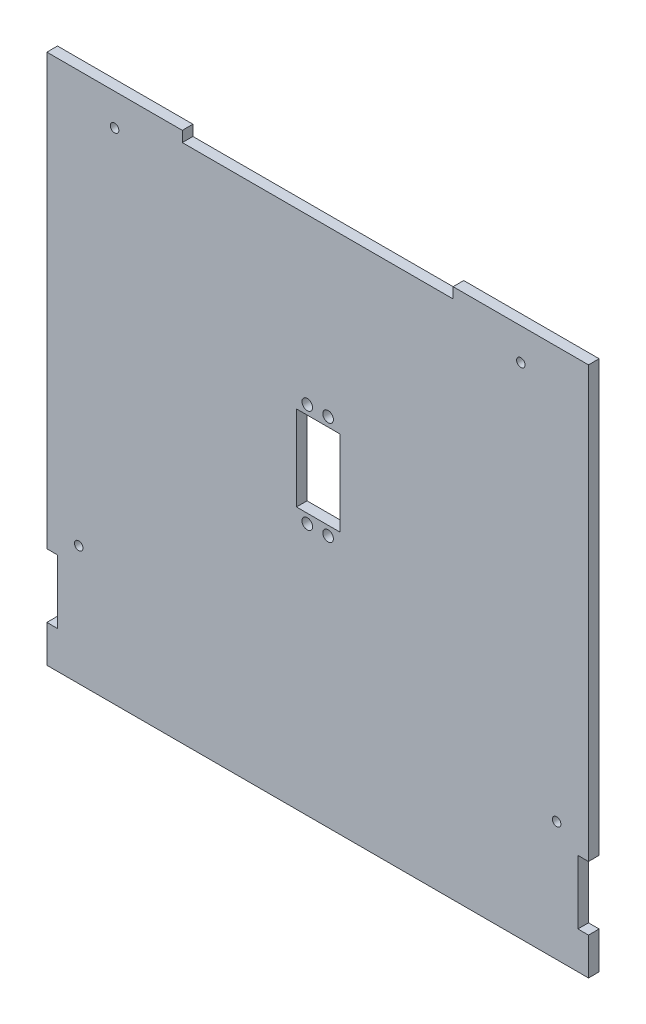
ISO-10303-21;
HEADER;
FILE_DESCRIPTION(('STEP AP214'),'2;1');
FILE_NAME('part.step','',(''),(''),'','','');
FILE_SCHEMA(('AUTOMOTIVE_DESIGN { 1 0 10303 214 1 1 1 1 }'));
ENDSEC;
DATA;
#1=APPLICATION_CONTEXT('core data for automotive mechanical design processes');
#2=APPLICATION_PROTOCOL_DEFINITION('international standard','automotive_design',2000,#1);
#3=PRODUCT_CONTEXT('',#1,'mechanical');
#4=PRODUCT('Part','Part','',(#3));
#5=PRODUCT_RELATED_PRODUCT_CATEGORY('part','',(#4));
#6=PRODUCT_DEFINITION_FORMATION('','',#4);
#7=PRODUCT_DEFINITION_CONTEXT('part definition',#1,'design');
#8=PRODUCT_DEFINITION('design','',#6,#7);
#9=PRODUCT_DEFINITION_SHAPE('','',#8);
#10=(LENGTH_UNIT() NAMED_UNIT(*) SI_UNIT(.MILLI.,.METRE.));
#11=(NAMED_UNIT(*) PLANE_ANGLE_UNIT() SI_UNIT($,.RADIAN.));
#12=(NAMED_UNIT(*) SI_UNIT($,.STERADIAN.) SOLID_ANGLE_UNIT());
#13=UNCERTAINTY_MEASURE_WITH_UNIT(LENGTH_MEASURE(1.E-05),#10,'distance_accuracy_value','');
#14=(GEOMETRIC_REPRESENTATION_CONTEXT(3) GLOBAL_UNCERTAINTY_ASSIGNED_CONTEXT((#13)) GLOBAL_UNIT_ASSIGNED_CONTEXT((#10,
#11,#12)) REPRESENTATION_CONTEXT('',''));
#15=CARTESIAN_POINT('',(0.,0.,0.));
#16=DIRECTION('',(0.,0.,1.));
#17=DIRECTION('',(1.,0.,0.));
#18=AXIS2_PLACEMENT_3D('',#15,#16,#17);
#19=CARTESIAN_POINT('',(0.,0.,5.));
#20=DIRECTION('',(0.,0.,1.));
#21=DIRECTION('',(1.,0.,0.));
#22=AXIS2_PLACEMENT_3D('',#19,#20,#21);
#23=PLANE('',#22);
#24=CARTESIAN_POINT('',(110.,-68.75,5.));
#25=DIRECTION('',(0.,0.,1.));
#26=DIRECTION('',(1.,0.,0.));
#27=AXIS2_PLACEMENT_3D('',#24,#25,#26);
#28=CIRCLE('',#27,2.);
#29=CARTESIAN_POINT('',(112.,-68.75,5.));
#30=VERTEX_POINT('',#29);
#31=EDGE_CURVE('E189',#30,#30,#28,.T.);
#32=ORIENTED_EDGE('',*,*,#31,.F.);
#33=EDGE_LOOP('',(#32));
#34=FACE_BOUND('',#33,.T.);
#35=CARTESIAN_POINT('',(-115.,-68.75,5.));
#36=DIRECTION('',(0.,0.,1.));
#37=DIRECTION('',(1.,0.,0.));
#38=AXIS2_PLACEMENT_3D('',#35,#36,#37);
#39=CIRCLE('',#38,2.);
#40=CARTESIAN_POINT('',(-113.,-68.75,5.));
#41=VERTEX_POINT('',#40);
#42=EDGE_CURVE('E351',#41,#41,#39,.T.);
#43=ORIENTED_EDGE('',*,*,#42,.F.);
#44=EDGE_LOOP('',(#43));
#45=FACE_BOUND('',#44,.T.);
#46=CARTESIAN_POINT('',(-98.125,110.,5.));
#47=DIRECTION('',(0.,0.,1.));
#48=DIRECTION('',(1.,0.,0.));
#49=AXIS2_PLACEMENT_3D('',#46,#47,#48);
#50=CIRCLE('',#49,2.);
#51=CARTESIAN_POINT('',(-96.125,110.,5.));
#52=VERTEX_POINT('',#51);
#53=EDGE_CURVE('E354',#52,#52,#50,.T.);
#54=ORIENTED_EDGE('',*,*,#53,.F.);
#55=EDGE_LOOP('',(#54));
#56=FACE_BOUND('',#55,.T.);
#57=CARTESIAN_POINT('',(93.125,110.,5.));
#58=DIRECTION('',(0.,0.,1.));
#59=DIRECTION('',(1.,0.,0.));
#60=AXIS2_PLACEMENT_3D('',#57,#58,#59);
#61=CIRCLE('',#60,2.);
#62=CARTESIAN_POINT('',(95.125,110.,5.));
#63=VERTEX_POINT('',#62);
#64=EDGE_CURVE('E357',#63,#63,#61,.T.);
#65=ORIENTED_EDGE('',*,*,#64,.F.);
#66=EDGE_LOOP('',(#65));
#67=FACE_BOUND('',#66,.T.);
#68=DIRECTION('',(0.,-1.,0.));
#69=VECTOR('',#68,1.);
#70=CARTESIAN_POINT('',(-66.25,0.,5.));
#71=LINE('',#70,#69);
#72=CARTESIAN_POINT('',(-66.25,125.,5.));
#73=VERTEX_POINT('',#72);
#74=CARTESIAN_POINT('',(-66.25,120.,5.));
#75=VERTEX_POINT('',#74);
#76=EDGE_CURVE('E339',#73,#75,#71,.T.);
#77=ORIENTED_EDGE('',*,*,#76,.F.);
#78=DIRECTION('',(-1.,0.,0.));
#79=VECTOR('',#78,1.);
#80=CARTESIAN_POINT('',(-130.,125.,5.));
#81=LINE('',#80,#79);
#82=CARTESIAN_POINT('',(-130.,125.,5.));
#83=VERTEX_POINT('',#82);
#84=EDGE_CURVE('E198',#73,#83,#81,.T.);
#85=ORIENTED_EDGE('',*,*,#84,.T.);
#86=DIRECTION('',(0.,1.,0.));
#87=VECTOR('',#86,1.);
#88=CARTESIAN_POINT('',(-130.,0.,5.));
#89=LINE('',#88,#87);
#90=CARTESIAN_POINT('',(-130.,-77.5,5.));
#91=VERTEX_POINT('',#90);
#92=EDGE_CURVE('E321',#91,#83,#89,.T.);
#93=ORIENTED_EDGE('',*,*,#92,.F.);
#94=DIRECTION('',(-1.,0.,0.));
#95=VECTOR('',#94,1.);
#96=CARTESIAN_POINT('',(4.30211422042244E-13,-77.4999999999993,5.));
#97=LINE('',#96,#95);
#98=CARTESIAN_POINT('',(-125.,-77.5,5.));
#99=VERTEX_POINT('',#98);
#100=EDGE_CURVE('E266',#99,#91,#97,.T.);
#101=ORIENTED_EDGE('',*,*,#100,.F.);
#102=DIRECTION('',(0.,1.,0.));
#103=VECTOR('',#102,1.);
#104=CARTESIAN_POINT('',(-125.,0.,5.));
#105=LINE('',#104,#103);
#106=CARTESIAN_POINT('',(-125.,-107.5,5.));
#107=VERTEX_POINT('',#106);
#108=EDGE_CURVE('E264',#107,#99,#105,.T.);
#109=ORIENTED_EDGE('',*,*,#108,.F.);
#110=DIRECTION('',(1.,0.,0.));
#111=VECTOR('',#110,1.);
#112=CARTESIAN_POINT('',(5.96744875736017E-13,-107.499999999999,5.));
#113=LINE('',#112,#111);
#114=CARTESIAN_POINT('',(-130.,-107.5,5.));
#115=VERTEX_POINT('',#114);
#116=EDGE_CURVE('E269',#115,#107,#113,.T.);
#117=ORIENTED_EDGE('',*,*,#116,.F.);
#118=CARTESIAN_POINT('',(-130.,-125.,5.));
#119=VERTEX_POINT('',#118);
#120=EDGE_CURVE('E58',#119,#115,#89,.T.);
#121=ORIENTED_EDGE('',*,*,#120,.F.);
#122=DIRECTION('',(1.,0.,0.));
#123=VECTOR('',#122,1.);
#124=CARTESIAN_POINT('',(-130.,-125.,5.));
#125=LINE('',#124,#123);
#126=CARTESIAN_POINT('',(125.,-125.,5.));
#127=VERTEX_POINT('',#126);
#128=EDGE_CURVE('E194',#119,#127,#125,.T.);
#129=ORIENTED_EDGE('',*,*,#128,.T.);
#130=DIRECTION('',(0.,-1.,0.));
#131=VECTOR('',#130,1.);
#132=CARTESIAN_POINT('',(125.,0.,5.));
#133=LINE('',#132,#131);
#134=CARTESIAN_POINT('',(125.,-107.5,5.));
#135=VERTEX_POINT('',#134);
#136=EDGE_CURVE('E319',#135,#127,#133,.T.);
#137=ORIENTED_EDGE('',*,*,#136,.F.);
#138=DIRECTION('',(-1.,0.,0.));
#139=VECTOR('',#138,1.);
#140=CARTESIAN_POINT('',(0.,-107.5,5.));
#141=LINE('',#140,#139);
#142=CARTESIAN_POINT('',(120.,-107.5,5.));
#143=VERTEX_POINT('',#142);
#144=EDGE_CURVE('E271',#135,#143,#141,.T.);
#145=ORIENTED_EDGE('',*,*,#144,.T.);
#146=DIRECTION('',(0.,1.,0.));
#147=VECTOR('',#146,1.);
#148=CARTESIAN_POINT('',(120.,0.,5.));
#149=LINE('',#148,#147);
#150=CARTESIAN_POINT('',(120.,-77.5,5.));
#151=VERTEX_POINT('',#150);
#152=EDGE_CURVE('E277',#143,#151,#149,.T.);
#153=ORIENTED_EDGE('',*,*,#152,.T.);
#154=DIRECTION('',(1.,0.,0.));
#155=VECTOR('',#154,1.);
#156=CARTESIAN_POINT('',(0.,-77.5,5.));
#157=LINE('',#156,#155);
#158=CARTESIAN_POINT('',(125.,-77.5,5.));
#159=VERTEX_POINT('',#158);
#160=EDGE_CURVE('E274',#151,#159,#157,.T.);
#161=ORIENTED_EDGE('',*,*,#160,.T.);
#162=CARTESIAN_POINT('',(125.,125.,5.));
#163=VERTEX_POINT('',#162);
#164=EDGE_CURVE('E301',#163,#159,#133,.T.);
#165=ORIENTED_EDGE('',*,*,#164,.F.);
#166=CARTESIAN_POINT('',(61.25,125.,5.));
#167=VERTEX_POINT('',#166);
#168=EDGE_CURVE('E205',#163,#167,#81,.T.);
#169=ORIENTED_EDGE('',*,*,#168,.T.);
#170=DIRECTION('',(0.,1.,0.));
#171=VECTOR('',#170,1.);
#172=CARTESIAN_POINT('',(61.25,0.,5.));
#173=LINE('',#172,#171);
#174=CARTESIAN_POINT('',(61.25,120.,5.));
#175=VERTEX_POINT('',#174);
#176=EDGE_CURVE('E50',#175,#167,#173,.T.);
#177=ORIENTED_EDGE('',*,*,#176,.F.);
#178=DIRECTION('',(1.,0.,0.));
#179=VECTOR('',#178,1.);
#180=CARTESIAN_POINT('',(0.,120.,5.));
#181=LINE('',#180,#179);
#182=EDGE_CURVE('E337',#75,#175,#181,.T.);
#183=ORIENTED_EDGE('',*,*,#182,.F.);
#184=EDGE_LOOP('',(#77,#85,#93,#101,#109,#117,#121,#129,#137,#145,#153,#161,#165,#169,#177,#183));
#185=FACE_BOUND('',#184,.T.);
#186=DIRECTION('',(0.,-1.,0.));
#187=VECTOR('',#186,1.);
#188=CARTESIAN_POINT('',(7.99999999999994,0.,5.));
#189=LINE('',#188,#187);
#190=CARTESIAN_POINT('',(7.99999999999994,38.3,5.));
#191=VERTEX_POINT('',#190);
#192=CARTESIAN_POINT('',(7.99999999999994,-1.70000000000001,5.));
#193=VERTEX_POINT('',#192);
#194=EDGE_CURVE('E252',#191,#193,#189,.T.);
#195=ORIENTED_EDGE('',*,*,#194,.T.);
#196=DIRECTION('',(1.,0.,0.));
#197=VECTOR('',#196,1.);
#198=CARTESIAN_POINT('',(7.49999999999994,-1.70000000000001,5.));
#199=LINE('',#198,#197);
#200=CARTESIAN_POINT('',(-12.5000000000001,-1.70000000000001,5.));
#201=VERTEX_POINT('',#200);
#202=EDGE_CURVE('E222',#201,#193,#199,.T.);
#203=ORIENTED_EDGE('',*,*,#202,.F.);
#204=DIRECTION('',(0.,-1.,0.));
#205=VECTOR('',#204,1.);
#206=CARTESIAN_POINT('',(-12.5000000000001,0.,5.));
#207=LINE('',#206,#205);
#208=CARTESIAN_POINT('',(-12.5000000000001,38.3,5.));
#209=VERTEX_POINT('',#208);
#210=EDGE_CURVE('E212',#209,#201,#207,.T.);
#211=ORIENTED_EDGE('',*,*,#210,.F.);
#212=DIRECTION('',(-1.,0.,0.));
#213=VECTOR('',#212,1.);
#214=CARTESIAN_POINT('',(7.49999999999994,38.3,5.));
#215=LINE('',#214,#213);
#216=EDGE_CURVE('E217',#191,#209,#215,.T.);
#217=ORIENTED_EDGE('',*,*,#216,.F.);
#218=EDGE_LOOP('',(#195,#203,#211,#217));
#219=FACE_BOUND('',#218,.T.);
#220=CARTESIAN_POINT('',(-7.40000000000006,42.6,5.));
#221=DIRECTION('',(0.,0.,1.));
#222=DIRECTION('',(1.,0.,0.));
#223=AXIS2_PLACEMENT_3D('',#220,#221,#222);
#224=CIRCLE('',#223,2.5);
#225=CARTESIAN_POINT('',(-4.90000000000006,42.6,5.));
#226=VERTEX_POINT('',#225);
#227=EDGE_CURVE('E228',#226,#226,#224,.T.);
#228=ORIENTED_EDGE('',*,*,#227,.F.);
#229=EDGE_LOOP('',(#228));
#230=FACE_BOUND('',#229,.T.);
#231=CARTESIAN_POINT('',(2.39999999999994,-6.00000000000001,5.));
#232=DIRECTION('',(0.,0.,1.));
#233=DIRECTION('',(1.,0.,0.));
#234=AXIS2_PLACEMENT_3D('',#231,#232,#233);
#235=CIRCLE('',#234,2.5);
#236=CARTESIAN_POINT('',(4.89999999999994,-6.00000000000001,5.));
#237=VERTEX_POINT('',#236);
#238=EDGE_CURVE('E231',#237,#237,#235,.T.);
#239=ORIENTED_EDGE('',*,*,#238,.F.);
#240=EDGE_LOOP('',(#239));
#241=FACE_BOUND('',#240,.T.);
#242=CARTESIAN_POINT('',(-7.40000000000006,-6.00000000000001,5.));
#243=DIRECTION('',(0.,0.,1.));
#244=DIRECTION('',(1.,0.,0.));
#245=AXIS2_PLACEMENT_3D('',#242,#243,#244);
#246=CIRCLE('',#245,2.5);
#247=CARTESIAN_POINT('',(-4.90000000000006,-6.00000000000001,5.));
#248=VERTEX_POINT('',#247);
#249=EDGE_CURVE('E234',#248,#248,#246,.T.);
#250=ORIENTED_EDGE('',*,*,#249,.F.);
#251=EDGE_LOOP('',(#250));
#252=FACE_BOUND('',#251,.T.);
#253=CARTESIAN_POINT('',(2.39999999999994,42.6,5.));
#254=DIRECTION('',(0.,0.,1.));
#255=DIRECTION('',(1.,0.,0.));
#256=AXIS2_PLACEMENT_3D('',#253,#254,#255);
#257=CIRCLE('',#256,2.5);
#258=CARTESIAN_POINT('',(4.89999999999994,42.6,5.));
#259=VERTEX_POINT('',#258);
#260=EDGE_CURVE('E237',#259,#259,#257,.T.);
#261=ORIENTED_EDGE('',*,*,#260,.F.);
#262=EDGE_LOOP('',(#261));
#263=FACE_BOUND('',#262,.T.);
#264=ADVANCED_FACE('F35',(#34,#45,#56,#67,#185,#219,#230,#241,#252,#263),#23,.T.);
#265=CARTESIAN_POINT('',(0.,0.,0.));
#266=DIRECTION('',(0.,0.,1.));
#267=DIRECTION('',(1.,0.,0.));
#268=AXIS2_PLACEMENT_3D('',#265,#266,#267);
#269=PLANE('',#268);
#270=CARTESIAN_POINT('',(110.,-68.75,0.));
#271=DIRECTION('',(0.,0.,-1.));
#272=DIRECTION('',(-1.,0.,0.));
#273=AXIS2_PLACEMENT_3D('',#270,#271,#272);
#274=CIRCLE('',#273,2.);
#275=CARTESIAN_POINT('',(108.,-68.75,0.));
#276=VERTEX_POINT('',#275);
#277=EDGE_CURVE('E364',#276,#276,#274,.T.);
#278=ORIENTED_EDGE('',*,*,#277,.F.);
#279=EDGE_LOOP('',(#278));
#280=FACE_BOUND('',#279,.T.);
#281=CARTESIAN_POINT('',(-115.,-68.75,0.));
#282=DIRECTION('',(0.,0.,-1.));
#283=DIRECTION('',(-1.,0.,0.));
#284=AXIS2_PLACEMENT_3D('',#281,#282,#283);
#285=CIRCLE('',#284,2.);
#286=CARTESIAN_POINT('',(-117.,-68.75,0.));
#287=VERTEX_POINT('',#286);
#288=EDGE_CURVE('E367',#287,#287,#285,.T.);
#289=ORIENTED_EDGE('',*,*,#288,.F.);
#290=EDGE_LOOP('',(#289));
#291=FACE_BOUND('',#290,.T.);
#292=CARTESIAN_POINT('',(-98.125,110.,0.));
#293=DIRECTION('',(0.,0.,-1.));
#294=DIRECTION('',(-1.,0.,0.));
#295=AXIS2_PLACEMENT_3D('',#292,#293,#294);
#296=CIRCLE('',#295,2.);
#297=CARTESIAN_POINT('',(-100.125,110.,0.));
#298=VERTEX_POINT('',#297);
#299=EDGE_CURVE('E363',#298,#298,#296,.T.);
#300=ORIENTED_EDGE('',*,*,#299,.F.);
#301=EDGE_LOOP('',(#300));
#302=FACE_BOUND('',#301,.T.);
#303=CARTESIAN_POINT('',(93.125,110.,0.));
#304=DIRECTION('',(0.,0.,-1.));
#305=DIRECTION('',(-1.,0.,0.));
#306=AXIS2_PLACEMENT_3D('',#303,#304,#305);
#307=CIRCLE('',#306,2.);
#308=CARTESIAN_POINT('',(91.125,110.,0.));
#309=VERTEX_POINT('',#308);
#310=EDGE_CURVE('E360',#309,#309,#307,.T.);
#311=ORIENTED_EDGE('',*,*,#310,.F.);
#312=EDGE_LOOP('',(#311));
#313=FACE_BOUND('',#312,.T.);
#314=CARTESIAN_POINT('',(2.39999999999994,42.6,0.));
#315=DIRECTION('',(0.,0.,-1.));
#316=DIRECTION('',(-1.,0.,0.));
#317=AXIS2_PLACEMENT_3D('',#314,#315,#316);
#318=CIRCLE('',#317,2.5);
#319=CARTESIAN_POINT('',(-0.10000000000006,42.6,0.));
#320=VERTEX_POINT('',#319);
#321=EDGE_CURVE('E240',#320,#320,#318,.T.);
#322=ORIENTED_EDGE('',*,*,#321,.F.);
#323=EDGE_LOOP('',(#322));
#324=FACE_BOUND('',#323,.T.);
#325=CARTESIAN_POINT('',(-7.40000000000006,-6.00000000000001,0.));
#326=DIRECTION('',(0.,0.,-1.));
#327=DIRECTION('',(-1.,0.,0.));
#328=AXIS2_PLACEMENT_3D('',#325,#326,#327);
#329=CIRCLE('',#328,2.5);
#330=CARTESIAN_POINT('',(-9.90000000000006,-6.00000000000001,0.));
#331=VERTEX_POINT('',#330);
#332=EDGE_CURVE('E247',#331,#331,#329,.T.);
#333=ORIENTED_EDGE('',*,*,#332,.F.);
#334=EDGE_LOOP('',(#333));
#335=FACE_BOUND('',#334,.T.);
#336=CARTESIAN_POINT('',(2.39999999999994,-6.00000000000001,0.));
#337=DIRECTION('',(0.,0.,-1.));
#338=DIRECTION('',(-1.,0.,0.));
#339=AXIS2_PLACEMENT_3D('',#336,#337,#338);
#340=CIRCLE('',#339,2.5);
#341=CARTESIAN_POINT('',(-0.100000000000059,-6.00000000000001,0.));
#342=VERTEX_POINT('',#341);
#343=EDGE_CURVE('E244',#342,#342,#340,.T.);
#344=ORIENTED_EDGE('',*,*,#343,.F.);
#345=EDGE_LOOP('',(#344));
#346=FACE_BOUND('',#345,.T.);
#347=CARTESIAN_POINT('',(-7.40000000000006,42.6,0.));
#348=DIRECTION('',(0.,0.,-1.));
#349=DIRECTION('',(-1.,0.,0.));
#350=AXIS2_PLACEMENT_3D('',#347,#348,#349);
#351=CIRCLE('',#350,2.5);
#352=CARTESIAN_POINT('',(-9.90000000000006,42.6,0.));
#353=VERTEX_POINT('',#352);
#354=EDGE_CURVE('E243',#353,#353,#351,.T.);
#355=ORIENTED_EDGE('',*,*,#354,.F.);
#356=EDGE_LOOP('',(#355));
#357=FACE_BOUND('',#356,.T.);
#358=DIRECTION('',(1.,0.,0.));
#359=VECTOR('',#358,1.);
#360=CARTESIAN_POINT('',(7.49999999999994,-1.70000000000001,0.));
#361=LINE('',#360,#359);
#362=CARTESIAN_POINT('',(-12.5000000000001,-1.70000000000001,0.));
#363=VERTEX_POINT('',#362);
#364=CARTESIAN_POINT('',(7.99999999999994,-1.70000000000001,0.));
#365=VERTEX_POINT('',#364);
#366=EDGE_CURVE('E225',#363,#365,#361,.T.);
#367=ORIENTED_EDGE('',*,*,#366,.T.);
#368=DIRECTION('',(0.,-1.,0.));
#369=VECTOR('',#368,1.);
#370=CARTESIAN_POINT('',(7.99999999999994,0.,0.));
#371=LINE('',#370,#369);
#372=CARTESIAN_POINT('',(7.99999999999994,38.3,0.));
#373=VERTEX_POINT('',#372);
#374=EDGE_CURVE('E255',#373,#365,#371,.T.);
#375=ORIENTED_EDGE('',*,*,#374,.F.);
#376=DIRECTION('',(-1.,0.,0.));
#377=VECTOR('',#376,1.);
#378=CARTESIAN_POINT('',(7.49999999999994,38.3,0.));
#379=LINE('',#378,#377);
#380=CARTESIAN_POINT('',(-12.5000000000001,38.3,0.));
#381=VERTEX_POINT('',#380);
#382=EDGE_CURVE('E220',#373,#381,#379,.T.);
#383=ORIENTED_EDGE('',*,*,#382,.T.);
#384=DIRECTION('',(0.,-1.,0.));
#385=VECTOR('',#384,1.);
#386=CARTESIAN_POINT('',(-12.5000000000001,0.,0.));
#387=LINE('',#386,#385);
#388=EDGE_CURVE('E179',#381,#363,#387,.T.);
#389=ORIENTED_EDGE('',*,*,#388,.T.);
#390=EDGE_LOOP('',(#367,#375,#383,#389));
#391=FACE_BOUND('',#390,.T.);
#392=DIRECTION('',(-1.,0.,0.));
#393=VECTOR('',#392,1.);
#394=CARTESIAN_POINT('',(-130.,125.,0.));
#395=LINE('',#394,#393);
#396=CARTESIAN_POINT('',(-66.25,125.,0.));
#397=VERTEX_POINT('',#396);
#398=CARTESIAN_POINT('',(-130.,125.,0.));
#399=VERTEX_POINT('',#398);
#400=EDGE_CURVE('E195',#397,#399,#395,.T.);
#401=ORIENTED_EDGE('',*,*,#400,.F.);
#402=DIRECTION('',(0.,1.,0.));
#403=VECTOR('',#402,1.);
#404=CARTESIAN_POINT('',(-66.25,120.,0.));
#405=LINE('',#404,#403);
#406=CARTESIAN_POINT('',(-66.25,120.,0.));
#407=VERTEX_POINT('',#406);
#408=EDGE_CURVE('E345',#407,#397,#405,.T.);
#409=ORIENTED_EDGE('',*,*,#408,.F.);
#410=DIRECTION('',(-1.,0.,0.));
#411=VECTOR('',#410,1.);
#412=CARTESIAN_POINT('',(-2.50000000000003,120.,0.));
#413=LINE('',#412,#411);
#414=CARTESIAN_POINT('',(61.25,120.,0.));
#415=VERTEX_POINT('',#414);
#416=EDGE_CURVE('E188',#415,#407,#413,.T.);
#417=ORIENTED_EDGE('',*,*,#416,.F.);
#418=DIRECTION('',(0.,-1.,0.));
#419=VECTOR('',#418,1.);
#420=CARTESIAN_POINT('',(61.25,125.,0.));
#421=LINE('',#420,#419);
#422=CARTESIAN_POINT('',(61.25,125.,0.));
#423=VERTEX_POINT('',#422);
#424=EDGE_CURVE('E173',#423,#415,#421,.T.);
#425=ORIENTED_EDGE('',*,*,#424,.F.);
#426=CARTESIAN_POINT('',(125.,125.,0.));
#427=VERTEX_POINT('',#426);
#428=EDGE_CURVE('E185',#427,#423,#395,.T.);
#429=ORIENTED_EDGE('',*,*,#428,.F.);
#430=DIRECTION('',(0.,1.,0.));
#431=VECTOR('',#430,1.);
#432=CARTESIAN_POINT('',(125.,-125.,0.));
#433=LINE('',#432,#431);
#434=CARTESIAN_POINT('',(125.,-77.5,0.));
#435=VERTEX_POINT('',#434);
#436=EDGE_CURVE('E329',#435,#427,#433,.T.);
#437=ORIENTED_EDGE('',*,*,#436,.F.);
#438=DIRECTION('',(-1.,0.,0.));
#439=VECTOR('',#438,1.);
#440=CARTESIAN_POINT('',(125.,-77.5,0.));
#441=LINE('',#440,#439);
#442=CARTESIAN_POINT('',(120.,-77.5,0.));
#443=VERTEX_POINT('',#442);
#444=EDGE_CURVE('E285',#435,#443,#441,.T.);
#445=ORIENTED_EDGE('',*,*,#444,.T.);
#446=DIRECTION('',(0.,-1.,0.));
#447=VECTOR('',#446,1.);
#448=CARTESIAN_POINT('',(120.,-77.5,0.));
#449=LINE('',#448,#447);
#450=CARTESIAN_POINT('',(120.,-107.5,0.));
#451=VERTEX_POINT('',#450);
#452=EDGE_CURVE('E288',#443,#451,#449,.T.);
#453=ORIENTED_EDGE('',*,*,#452,.T.);
#454=DIRECTION('',(1.,0.,0.));
#455=VECTOR('',#454,1.);
#456=CARTESIAN_POINT('',(120.,-107.5,0.));
#457=LINE('',#456,#455);
#458=CARTESIAN_POINT('',(125.,-107.5,0.));
#459=VERTEX_POINT('',#458);
#460=EDGE_CURVE('E281',#451,#459,#457,.T.);
#461=ORIENTED_EDGE('',*,*,#460,.T.);
#462=CARTESIAN_POINT('',(125.,-125.,0.));
#463=VERTEX_POINT('',#462);
#464=EDGE_CURVE('E334',#463,#459,#433,.T.);
#465=ORIENTED_EDGE('',*,*,#464,.F.);
#466=DIRECTION('',(1.,0.,0.));
#467=VECTOR('',#466,1.);
#468=CARTESIAN_POINT('',(-130.,-125.,0.));
#469=LINE('',#468,#467);
#470=CARTESIAN_POINT('',(-130.,-125.,0.));
#471=VERTEX_POINT('',#470);
#472=EDGE_CURVE('E200',#471,#463,#469,.T.);
#473=ORIENTED_EDGE('',*,*,#472,.F.);
#474=DIRECTION('',(0.,-1.,0.));
#475=VECTOR('',#474,1.);
#476=CARTESIAN_POINT('',(-130.,-125.,0.));
#477=LINE('',#476,#475);
#478=CARTESIAN_POINT('',(-130.,-107.5,0.));
#479=VERTEX_POINT('',#478);
#480=EDGE_CURVE('E331',#479,#471,#477,.T.);
#481=ORIENTED_EDGE('',*,*,#480,.F.);
#482=DIRECTION('',(-1.,0.,0.));
#483=VECTOR('',#482,1.);
#484=CARTESIAN_POINT('',(5.96744875736017E-13,-107.499999999999,0.));
#485=LINE('',#484,#483);
#486=CARTESIAN_POINT('',(-125.,-107.5,0.));
#487=VERTEX_POINT('',#486);
#488=EDGE_CURVE('E314',#487,#479,#485,.T.);
#489=ORIENTED_EDGE('',*,*,#488,.F.);
#490=DIRECTION('',(0.,-1.,0.));
#491=VECTOR('',#490,1.);
#492=CARTESIAN_POINT('',(-125.,0.,0.));
#493=LINE('',#492,#491);
#494=CARTESIAN_POINT('',(-125.,-77.5,0.));
#495=VERTEX_POINT('',#494);
#496=EDGE_CURVE('E284',#495,#487,#493,.T.);
#497=ORIENTED_EDGE('',*,*,#496,.F.);
#498=DIRECTION('',(1.,0.,0.));
#499=VECTOR('',#498,1.);
#500=CARTESIAN_POINT('',(4.30211422042244E-13,-77.4999999999993,0.));
#501=LINE('',#500,#499);
#502=CARTESIAN_POINT('',(-130.,-77.5,0.));
#503=VERTEX_POINT('',#502);
#504=EDGE_CURVE('E306',#503,#495,#501,.T.);
#505=ORIENTED_EDGE('',*,*,#504,.F.);
#506=EDGE_CURVE('E326',#399,#503,#477,.T.);
#507=ORIENTED_EDGE('',*,*,#506,.F.);
#508=EDGE_LOOP('',(#401,#409,#417,#425,#429,#437,#445,#453,#461,#465,#473,#481,#489,#497,#505,#507));
#509=FACE_BOUND('',#508,.T.);
#510=ADVANCED_FACE('F183',(#280,#291,#302,#313,#324,#335,#346,#357,#391,#509),#269,.F.);
#511=CARTESIAN_POINT('',(-130.,125.,5.));
#512=DIRECTION('',(0.,-1.,0.));
#513=DIRECTION('',(0.,0.,-1.));
#514=AXIS2_PLACEMENT_3D('',#511,#512,#513);
#515=PLANE('',#514);
#516=ORIENTED_EDGE('',*,*,#84,.F.);
#517=DIRECTION('',(0.,0.,-1.));
#518=VECTOR('',#517,1.);
#519=CARTESIAN_POINT('',(-66.25,125.,5.));
#520=LINE('',#519,#518);
#521=EDGE_CURVE('E11',#73,#397,#520,.T.);
#522=ORIENTED_EDGE('',*,*,#521,.T.);
#523=ORIENTED_EDGE('',*,*,#400,.T.);
#524=DIRECTION('',(0.,0.,-1.));
#525=VECTOR('',#524,1.);
#526=CARTESIAN_POINT('',(-130.,125.,10.));
#527=LINE('',#526,#525);
#528=EDGE_CURVE('E325',#83,#399,#527,.T.);
#529=ORIENTED_EDGE('',*,*,#528,.F.);
#530=EDGE_LOOP('',(#516,#522,#523,#529));
#531=FACE_BOUND('',#530,.T.);
#532=ADVANCED_FACE('F377',(#531),#515,.F.);
#533=CARTESIAN_POINT('',(-130.,-125.,5.));
#534=DIRECTION('',(0.,1.,0.));
#535=DIRECTION('',(0.,0.,1.));
#536=AXIS2_PLACEMENT_3D('',#533,#534,#535);
#537=PLANE('',#536);
#538=ORIENTED_EDGE('',*,*,#472,.T.);
#539=DIRECTION('',(0.,0.,-1.));
#540=VECTOR('',#539,1.);
#541=CARTESIAN_POINT('',(125.,-125.,10.));
#542=LINE('',#541,#540);
#543=EDGE_CURVE('E333',#127,#463,#542,.T.);
#544=ORIENTED_EDGE('',*,*,#543,.F.);
#545=ORIENTED_EDGE('',*,*,#128,.F.);
#546=DIRECTION('',(0.,0.,-1.));
#547=VECTOR('',#546,1.);
#548=CARTESIAN_POINT('',(-130.,-125.,10.));
#549=LINE('',#548,#547);
#550=EDGE_CURVE('E322',#119,#471,#549,.T.);
#551=ORIENTED_EDGE('',*,*,#550,.T.);
#552=EDGE_LOOP('',(#538,#544,#545,#551));
#553=FACE_BOUND('',#552,.T.);
#554=ADVANCED_FACE('F37',(#553),#537,.F.);
#555=ORIENTED_EDGE('',*,*,#428,.T.);
#556=DIRECTION('',(0.,0.,1.));
#557=VECTOR('',#556,1.);
#558=CARTESIAN_POINT('',(61.25,125.,5.));
#559=LINE('',#558,#557);
#560=EDGE_CURVE('E43',#423,#167,#559,.T.);
#561=ORIENTED_EDGE('',*,*,#560,.T.);
#562=ORIENTED_EDGE('',*,*,#168,.F.);
#563=DIRECTION('',(0.,0.,-1.));
#564=VECTOR('',#563,1.);
#565=CARTESIAN_POINT('',(125.,125.,10.));
#566=LINE('',#565,#564);
#567=EDGE_CURVE('E193',#163,#427,#566,.T.);
#568=ORIENTED_EDGE('',*,*,#567,.T.);
#569=EDGE_LOOP('',(#555,#561,#562,#568));
#570=FACE_BOUND('',#569,.T.);
#571=ADVANCED_FACE('F192',(#570),#515,.F.);
#572=CARTESIAN_POINT('',(-12.5000000000001,0.,-32.));
#573=DIRECTION('',(-1.,0.,0.));
#574=DIRECTION('',(0.,-1.,0.));
#575=AXIS2_PLACEMENT_3D('',#572,#573,#574);
#576=PLANE('',#575);
#577=ORIENTED_EDGE('',*,*,#210,.T.);
#578=DIRECTION('',(0.,0.,-1.));
#579=VECTOR('',#578,1.);
#580=CARTESIAN_POINT('',(-12.5000000000001,-1.70000000000001,26.2735163995048));
#581=LINE('',#580,#579);
#582=EDGE_CURVE('E223',#201,#363,#581,.T.);
#583=ORIENTED_EDGE('',*,*,#582,.T.);
#584=ORIENTED_EDGE('',*,*,#388,.F.);
#585=DIRECTION('',(0.,0.,-1.));
#586=VECTOR('',#585,1.);
#587=CARTESIAN_POINT('',(-12.5000000000001,38.3,26.2735163995048));
#588=LINE('',#587,#586);
#589=EDGE_CURVE('E214',#209,#381,#588,.T.);
#590=ORIENTED_EDGE('',*,*,#589,.F.);
#591=EDGE_LOOP('',(#577,#583,#584,#590));
#592=FACE_BOUND('',#591,.T.);
#593=ADVANCED_FACE('F403',(#592),#576,.F.);
#594=CARTESIAN_POINT('',(7.49999999999994,38.3,26.2735163995048));
#595=DIRECTION('',(0.,-1.,0.));
#596=DIRECTION('',(0.,0.,-1.));
#597=AXIS2_PLACEMENT_3D('',#594,#595,#596);
#598=PLANE('',#597);
#599=ORIENTED_EDGE('',*,*,#382,.F.);
#600=DIRECTION('',(0.,0.,-1.));
#601=VECTOR('',#600,1.);
#602=CARTESIAN_POINT('',(7.99999999999994,38.3,5.70710678118655));
#603=LINE('',#602,#601);
#604=EDGE_CURVE('E258',#191,#373,#603,.T.);
#605=ORIENTED_EDGE('',*,*,#604,.F.);
#606=ORIENTED_EDGE('',*,*,#216,.T.);
#607=ORIENTED_EDGE('',*,*,#589,.T.);
#608=EDGE_LOOP('',(#599,#605,#606,#607));
#609=FACE_BOUND('',#608,.T.);
#610=ADVANCED_FACE('F400',(#609),#598,.T.);
#611=CARTESIAN_POINT('',(7.49999999999994,-1.70000000000001,26.2735163995048));
#612=DIRECTION('',(0.,1.,0.));
#613=DIRECTION('',(-1.,0.,0.));
#614=AXIS2_PLACEMENT_3D('',#611,#612,#613);
#615=PLANE('',#614);
#616=ORIENTED_EDGE('',*,*,#582,.F.);
#617=ORIENTED_EDGE('',*,*,#202,.T.);
#618=DIRECTION('',(0.,0.,-1.));
#619=VECTOR('',#618,1.);
#620=CARTESIAN_POINT('',(7.99999999999994,-1.70000000000001,5.70710678118655));
#621=LINE('',#620,#619);
#622=EDGE_CURVE('E261',#193,#365,#621,.T.);
#623=ORIENTED_EDGE('',*,*,#622,.T.);
#624=ORIENTED_EDGE('',*,*,#366,.F.);
#625=EDGE_LOOP('',(#616,#617,#623,#624));
#626=FACE_BOUND('',#625,.T.);
#627=ADVANCED_FACE('F393',(#626),#615,.T.);
#628=CARTESIAN_POINT('',(2.39999999999994,42.6,23.));
#629=DIRECTION('',(0.,0.,-1.));
#630=DIRECTION('',(-1.,0.,0.));
#631=AXIS2_PLACEMENT_3D('',#628,#629,#630);
#632=CYLINDRICAL_SURFACE('',#631,2.5);
#633=ORIENTED_EDGE('',*,*,#260,.T.);
#634=EDGE_LOOP('',(#633));
#635=FACE_BOUND('',#634,.T.);
#636=ORIENTED_EDGE('',*,*,#321,.T.);
#637=EDGE_LOOP('',(#636));
#638=FACE_BOUND('',#637,.T.);
#639=ADVANCED_FACE('F417',(#635,#638),#632,.F.);
#640=CARTESIAN_POINT('',(-7.40000000000006,-6.00000000000001,23.));
#641=DIRECTION('',(0.,0.,-1.));
#642=DIRECTION('',(-1.,0.,0.));
#643=AXIS2_PLACEMENT_3D('',#640,#641,#642);
#644=CYLINDRICAL_SURFACE('',#643,2.5);
#645=ORIENTED_EDGE('',*,*,#249,.T.);
#646=EDGE_LOOP('',(#645));
#647=FACE_BOUND('',#646,.T.);
#648=ORIENTED_EDGE('',*,*,#332,.T.);
#649=EDGE_LOOP('',(#648));
#650=FACE_BOUND('',#649,.T.);
#651=ADVANCED_FACE('F420',(#647,#650),#644,.F.);
#652=CARTESIAN_POINT('',(2.39999999999994,-6.00000000000001,23.));
#653=DIRECTION('',(0.,0.,-1.));
#654=DIRECTION('',(-1.,0.,0.));
#655=AXIS2_PLACEMENT_3D('',#652,#653,#654);
#656=CYLINDRICAL_SURFACE('',#655,2.5);
#657=ORIENTED_EDGE('',*,*,#238,.T.);
#658=EDGE_LOOP('',(#657));
#659=FACE_BOUND('',#658,.T.);
#660=ORIENTED_EDGE('',*,*,#343,.T.);
#661=EDGE_LOOP('',(#660));
#662=FACE_BOUND('',#661,.T.);
#663=ADVANCED_FACE('F426',(#659,#662),#656,.F.);
#664=CARTESIAN_POINT('',(-7.40000000000006,42.6,23.));
#665=DIRECTION('',(0.,0.,-1.));
#666=DIRECTION('',(-1.,0.,0.));
#667=AXIS2_PLACEMENT_3D('',#664,#665,#666);
#668=CYLINDRICAL_SURFACE('',#667,2.5);
#669=ORIENTED_EDGE('',*,*,#227,.T.);
#670=EDGE_LOOP('',(#669));
#671=FACE_BOUND('',#670,.T.);
#672=ORIENTED_EDGE('',*,*,#354,.T.);
#673=EDGE_LOOP('',(#672));
#674=FACE_BOUND('',#673,.T.);
#675=ADVANCED_FACE('F519',(#671,#674),#668,.F.);
#676=CARTESIAN_POINT('',(7.99999999999994,0.,70.));
#677=DIRECTION('',(1.,0.,0.));
#678=DIRECTION('',(0.,0.,-1.));
#679=AXIS2_PLACEMENT_3D('',#676,#677,#678);
#680=PLANE('',#679);
#681=ORIENTED_EDGE('',*,*,#374,.T.);
#682=ORIENTED_EDGE('',*,*,#622,.F.);
#683=ORIENTED_EDGE('',*,*,#194,.F.);
#684=ORIENTED_EDGE('',*,*,#604,.T.);
#685=EDGE_LOOP('',(#681,#682,#683,#684));
#686=FACE_BOUND('',#685,.T.);
#687=ADVANCED_FACE('F397',(#686),#680,.F.);
#688=CARTESIAN_POINT('',(120.,-107.5,10.));
#689=DIRECTION('',(0.,1.,0.));
#690=DIRECTION('',(0.,0.,1.));
#691=AXIS2_PLACEMENT_3D('',#688,#689,#690);
#692=PLANE('',#691);
#693=DIRECTION('',(0.,0.,-1.));
#694=VECTOR('',#693,1.);
#695=CARTESIAN_POINT('',(125.,-107.5,10.));
#696=LINE('',#695,#694);
#697=EDGE_CURVE('E298',#135,#459,#696,.T.);
#698=ORIENTED_EDGE('',*,*,#697,.T.);
#699=ORIENTED_EDGE('',*,*,#460,.F.);
#700=DIRECTION('',(0.,0.,-1.));
#701=VECTOR('',#700,1.);
#702=CARTESIAN_POINT('',(120.,-107.5,10.));
#703=LINE('',#702,#701);
#704=EDGE_CURVE('E291',#143,#451,#703,.T.);
#705=ORIENTED_EDGE('',*,*,#704,.F.);
#706=ORIENTED_EDGE('',*,*,#144,.F.);
#707=EDGE_LOOP('',(#698,#699,#705,#706));
#708=FACE_BOUND('',#707,.T.);
#709=ADVANCED_FACE('F482',(#708),#692,.T.);
#710=CARTESIAN_POINT('',(125.,-77.5,10.));
#711=DIRECTION('',(0.,-1.,0.));
#712=DIRECTION('',(0.,0.,-1.));
#713=AXIS2_PLACEMENT_3D('',#710,#711,#712);
#714=PLANE('',#713);
#715=DIRECTION('',(0.,0.,-1.));
#716=VECTOR('',#715,1.);
#717=CARTESIAN_POINT('',(120.,-77.5,10.));
#718=LINE('',#717,#716);
#719=EDGE_CURVE('E294',#151,#443,#718,.T.);
#720=ORIENTED_EDGE('',*,*,#719,.T.);
#721=ORIENTED_EDGE('',*,*,#444,.F.);
#722=DIRECTION('',(0.,0.,-1.));
#723=VECTOR('',#722,1.);
#724=CARTESIAN_POINT('',(125.,-77.5,10.));
#725=LINE('',#724,#723);
#726=EDGE_CURVE('E296',#159,#435,#725,.T.);
#727=ORIENTED_EDGE('',*,*,#726,.F.);
#728=ORIENTED_EDGE('',*,*,#160,.F.);
#729=EDGE_LOOP('',(#720,#721,#727,#728));
#730=FACE_BOUND('',#729,.T.);
#731=ADVANCED_FACE('F489',(#730),#714,.T.);
#732=CARTESIAN_POINT('',(120.,-77.5,10.));
#733=DIRECTION('',(1.,0.,0.));
#734=DIRECTION('',(0.,1.,0.));
#735=AXIS2_PLACEMENT_3D('',#732,#733,#734);
#736=PLANE('',#735);
#737=ORIENTED_EDGE('',*,*,#704,.T.);
#738=ORIENTED_EDGE('',*,*,#452,.F.);
#739=ORIENTED_EDGE('',*,*,#719,.F.);
#740=ORIENTED_EDGE('',*,*,#152,.F.);
#741=EDGE_LOOP('',(#737,#738,#739,#740));
#742=FACE_BOUND('',#741,.T.);
#743=ADVANCED_FACE('F485',(#742),#736,.T.);
#744=CARTESIAN_POINT('',(-125.,0.,10.));
#745=DIRECTION('',(1.,0.,0.));
#746=DIRECTION('',(0.,0.,-1.));
#747=AXIS2_PLACEMENT_3D('',#744,#745,#746);
#748=PLANE('',#747);
#749=ORIENTED_EDGE('',*,*,#108,.T.);
#750=DIRECTION('',(0.,0.,-1.));
#751=VECTOR('',#750,1.);
#752=CARTESIAN_POINT('',(-125.,-77.5,10.));
#753=LINE('',#752,#751);
#754=EDGE_CURVE('E280',#99,#495,#753,.T.);
#755=ORIENTED_EDGE('',*,*,#754,.T.);
#756=ORIENTED_EDGE('',*,*,#496,.T.);
#757=DIRECTION('',(0.,0.,-1.));
#758=VECTOR('',#757,1.);
#759=CARTESIAN_POINT('',(-125.,-107.5,10.));
#760=LINE('',#759,#758);
#761=EDGE_CURVE('E302',#107,#487,#760,.T.);
#762=ORIENTED_EDGE('',*,*,#761,.F.);
#763=EDGE_LOOP('',(#749,#755,#756,#762));
#764=FACE_BOUND('',#763,.T.);
#765=ADVANCED_FACE('F466',(#764),#748,.F.);
#766=CARTESIAN_POINT('',(4.30211422042244E-13,-77.4999999999993,10.));
#767=DIRECTION('',(0.,1.,0.));
#768=DIRECTION('',(-1.,0.,0.));
#769=AXIS2_PLACEMENT_3D('',#766,#767,#768);
#770=PLANE('',#769);
#771=ORIENTED_EDGE('',*,*,#100,.T.);
#772=DIRECTION('',(0.,0.,-1.));
#773=VECTOR('',#772,1.);
#774=CARTESIAN_POINT('',(-130.,-77.5,10.));
#775=LINE('',#774,#773);
#776=EDGE_CURVE('E308',#91,#503,#775,.T.);
#777=ORIENTED_EDGE('',*,*,#776,.T.);
#778=ORIENTED_EDGE('',*,*,#504,.T.);
#779=ORIENTED_EDGE('',*,*,#754,.F.);
#780=EDGE_LOOP('',(#771,#777,#778,#779));
#781=FACE_BOUND('',#780,.T.);
#782=ADVANCED_FACE('F459',(#781),#770,.F.);
#783=CARTESIAN_POINT('',(5.96744875736017E-13,-107.499999999999,10.));
#784=DIRECTION('',(0.,-1.,0.));
#785=DIRECTION('',(1.,0.,0.));
#786=AXIS2_PLACEMENT_3D('',#783,#784,#785);
#787=PLANE('',#786);
#788=ORIENTED_EDGE('',*,*,#116,.T.);
#789=ORIENTED_EDGE('',*,*,#761,.T.);
#790=ORIENTED_EDGE('',*,*,#488,.T.);
#791=DIRECTION('',(0.,0.,-1.));
#792=VECTOR('',#791,1.);
#793=CARTESIAN_POINT('',(-130.,-107.5,10.));
#794=LINE('',#793,#792);
#795=EDGE_CURVE('E305',#115,#479,#794,.T.);
#796=ORIENTED_EDGE('',*,*,#795,.F.);
#797=EDGE_LOOP('',(#788,#789,#790,#796));
#798=FACE_BOUND('',#797,.T.);
#799=ADVANCED_FACE('F469',(#798),#787,.F.);
#800=CARTESIAN_POINT('',(-130.,-125.,10.));
#801=DIRECTION('',(1.,0.,0.));
#802=DIRECTION('',(0.,0.,-1.));
#803=AXIS2_PLACEMENT_3D('',#800,#801,#802);
#804=PLANE('',#803);
#805=ORIENTED_EDGE('',*,*,#120,.T.);
#806=ORIENTED_EDGE('',*,*,#795,.T.);
#807=ORIENTED_EDGE('',*,*,#480,.T.);
#808=ORIENTED_EDGE('',*,*,#550,.F.);
#809=EDGE_LOOP('',(#805,#806,#807,#808));
#810=FACE_BOUND('',#809,.T.);
#811=ADVANCED_FACE('F500',(#810),#804,.F.);
#812=ORIENTED_EDGE('',*,*,#92,.T.);
#813=ORIENTED_EDGE('',*,*,#528,.T.);
#814=ORIENTED_EDGE('',*,*,#506,.T.);
#815=ORIENTED_EDGE('',*,*,#776,.F.);
#816=EDGE_LOOP('',(#812,#813,#814,#815));
#817=FACE_BOUND('',#816,.T.);
#818=ADVANCED_FACE('F455',(#817),#804,.F.);
#819=CARTESIAN_POINT('',(125.,-125.,10.));
#820=DIRECTION('',(-1.,0.,0.));
#821=DIRECTION('',(0.,0.,1.));
#822=AXIS2_PLACEMENT_3D('',#819,#820,#821);
#823=PLANE('',#822);
#824=ORIENTED_EDGE('',*,*,#164,.T.);
#825=ORIENTED_EDGE('',*,*,#726,.T.);
#826=ORIENTED_EDGE('',*,*,#436,.T.);
#827=ORIENTED_EDGE('',*,*,#567,.F.);
#828=EDGE_LOOP('',(#824,#825,#826,#827));
#829=FACE_BOUND('',#828,.T.);
#830=ADVANCED_FACE('F492',(#829),#823,.F.);
#831=ORIENTED_EDGE('',*,*,#136,.T.);
#832=ORIENTED_EDGE('',*,*,#543,.T.);
#833=ORIENTED_EDGE('',*,*,#464,.T.);
#834=ORIENTED_EDGE('',*,*,#697,.F.);
#835=EDGE_LOOP('',(#831,#832,#833,#834));
#836=FACE_BOUND('',#835,.T.);
#837=ADVANCED_FACE('F478',(#836),#823,.F.);
#838=CARTESIAN_POINT('',(-66.25,120.,185.));
#839=DIRECTION('',(-1.,0.,0.));
#840=DIRECTION('',(0.,0.,1.));
#841=AXIS2_PLACEMENT_3D('',#838,#839,#840);
#842=PLANE('',#841);
#843=ORIENTED_EDGE('',*,*,#76,.T.);
#844=DIRECTION('',(0.,0.,-1.));
#845=VECTOR('',#844,1.);
#846=CARTESIAN_POINT('',(-66.25,120.,185.));
#847=LINE('',#846,#845);
#848=EDGE_CURVE('E342',#75,#407,#847,.T.);
#849=ORIENTED_EDGE('',*,*,#848,.T.);
#850=ORIENTED_EDGE('',*,*,#408,.T.);
#851=ORIENTED_EDGE('',*,*,#521,.F.);
#852=EDGE_LOOP('',(#843,#849,#850,#851));
#853=FACE_BOUND('',#852,.T.);
#854=ADVANCED_FACE('F499',(#853),#842,.F.);
#855=CARTESIAN_POINT('',(-2.50000000000003,120.,185.));
#856=DIRECTION('',(0.,-1.,0.));
#857=DIRECTION('',(0.,0.,-1.));
#858=AXIS2_PLACEMENT_3D('',#855,#856,#857);
#859=PLANE('',#858);
#860=ORIENTED_EDGE('',*,*,#182,.T.);
#861=DIRECTION('',(0.,0.,-1.));
#862=VECTOR('',#861,1.);
#863=CARTESIAN_POINT('',(61.25,120.,185.));
#864=LINE('',#863,#862);
#865=EDGE_CURVE('E343',#175,#415,#864,.T.);
#866=ORIENTED_EDGE('',*,*,#865,.T.);
#867=ORIENTED_EDGE('',*,*,#416,.T.);
#868=ORIENTED_EDGE('',*,*,#848,.F.);
#869=EDGE_LOOP('',(#860,#866,#867,#868));
#870=FACE_BOUND('',#869,.T.);
#871=ADVANCED_FACE('F628',(#870),#859,.F.);
#872=CARTESIAN_POINT('',(61.25,125.,185.));
#873=DIRECTION('',(1.,0.,0.));
#874=DIRECTION('',(0.,0.,-1.));
#875=AXIS2_PLACEMENT_3D('',#872,#873,#874);
#876=PLANE('',#875);
#877=ORIENTED_EDGE('',*,*,#176,.T.);
#878=ORIENTED_EDGE('',*,*,#560,.F.);
#879=ORIENTED_EDGE('',*,*,#424,.T.);
#880=ORIENTED_EDGE('',*,*,#865,.F.);
#881=EDGE_LOOP('',(#877,#878,#879,#880));
#882=FACE_BOUND('',#881,.T.);
#883=ADVANCED_FACE('F172',(#882),#876,.F.);
#884=CARTESIAN_POINT('',(93.125,110.,10.));
#885=DIRECTION('',(0.,0.,-1.));
#886=DIRECTION('',(-1.,0.,0.));
#887=AXIS2_PLACEMENT_3D('',#884,#885,#886);
#888=CYLINDRICAL_SURFACE('',#887,2.);
#889=ORIENTED_EDGE('',*,*,#64,.T.);
#890=EDGE_LOOP('',(#889));
#891=FACE_BOUND('',#890,.T.);
#892=ORIENTED_EDGE('',*,*,#310,.T.);
#893=EDGE_LOOP('',(#892));
#894=FACE_BOUND('',#893,.T.);
#895=ADVANCED_FACE('F642',(#891,#894),#888,.F.);
#896=CARTESIAN_POINT('',(-98.125,110.,10.));
#897=DIRECTION('',(0.,0.,-1.));
#898=DIRECTION('',(-1.,0.,0.));
#899=AXIS2_PLACEMENT_3D('',#896,#897,#898);
#900=CYLINDRICAL_SURFACE('',#899,2.);
#901=ORIENTED_EDGE('',*,*,#53,.T.);
#902=EDGE_LOOP('',(#901));
#903=FACE_BOUND('',#902,.T.);
#904=ORIENTED_EDGE('',*,*,#299,.T.);
#905=EDGE_LOOP('',(#904));
#906=FACE_BOUND('',#905,.T.);
#907=ADVANCED_FACE('F373',(#903,#906),#900,.F.);
#908=CARTESIAN_POINT('',(-115.,-68.75,10.));
#909=DIRECTION('',(0.,0.,-1.));
#910=DIRECTION('',(-1.,0.,0.));
#911=AXIS2_PLACEMENT_3D('',#908,#909,#910);
#912=CYLINDRICAL_SURFACE('',#911,2.);
#913=ORIENTED_EDGE('',*,*,#42,.T.);
#914=EDGE_LOOP('',(#913));
#915=FACE_BOUND('',#914,.T.);
#916=ORIENTED_EDGE('',*,*,#288,.T.);
#917=EDGE_LOOP('',(#916));
#918=FACE_BOUND('',#917,.T.);
#919=ADVANCED_FACE('F670',(#915,#918),#912,.F.);
#920=CARTESIAN_POINT('',(110.,-68.75,10.));
#921=DIRECTION('',(0.,0.,-1.));
#922=DIRECTION('',(-1.,0.,0.));
#923=AXIS2_PLACEMENT_3D('',#920,#921,#922);
#924=CYLINDRICAL_SURFACE('',#923,2.);
#925=ORIENTED_EDGE('',*,*,#31,.T.);
#926=EDGE_LOOP('',(#925));
#927=FACE_BOUND('',#926,.T.);
#928=ORIENTED_EDGE('',*,*,#277,.T.);
#929=EDGE_LOOP('',(#928));
#930=FACE_BOUND('',#929,.T.);
#931=ADVANCED_FACE('F678',(#927,#930),#924,.F.);
#932=CLOSED_SHELL('',(#264,#510,#532,#554,#571,#593,#610,#627,#639,#651,#663,#675,#687,#709,
#731,#743,#765,#782,#799,#811,#818,#830,#837,#854,#871,#883,#895,#907,#919,#931));
#933=MANIFOLD_SOLID_BREP('B2',#932);
#934=ADVANCED_BREP_SHAPE_REPRESENTATION('',(#18,#933),#14);
#935=SHAPE_DEFINITION_REPRESENTATION(#9,#934);
ENDSEC;
END-ISO-10303-21;
